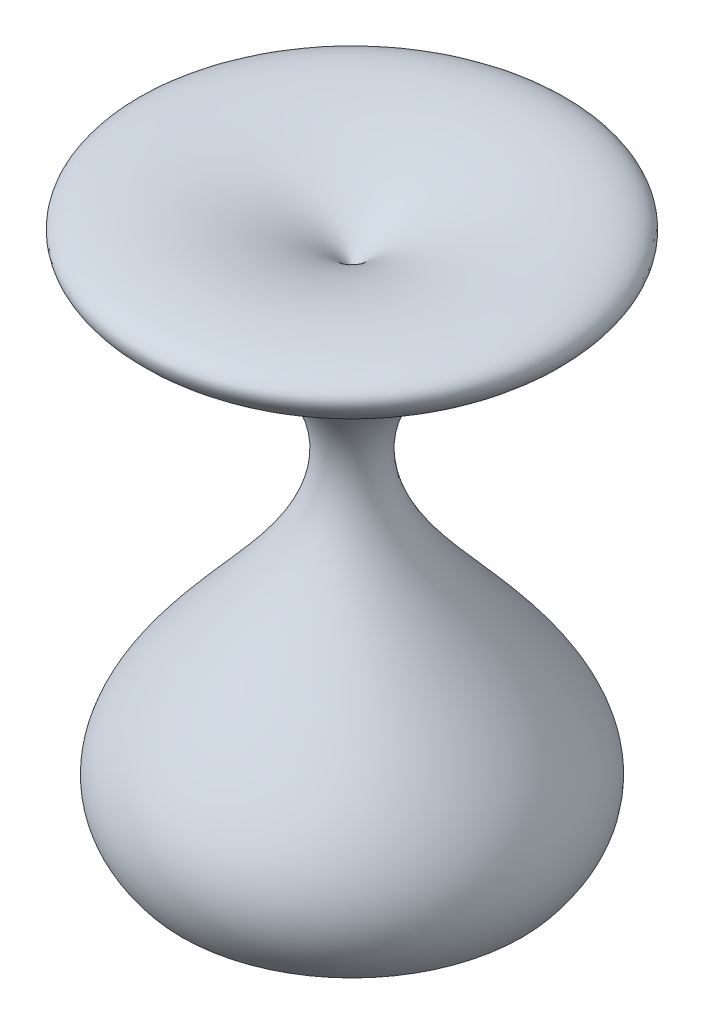
ISO-10303-21;
HEADER;
FILE_DESCRIPTION(('STEP AP214'),'2;1');
FILE_NAME('part.step','',(''),(''),'','','');
FILE_SCHEMA(('AUTOMOTIVE_DESIGN { 1 0 10303 214 1 1 1 1 }'));
ENDSEC;
DATA;
#1=APPLICATION_CONTEXT('core data for automotive mechanical design processes');
#2=APPLICATION_PROTOCOL_DEFINITION('international standard','automotive_design',2000,#1);
#3=PRODUCT_CONTEXT('',#1,'mechanical');
#4=PRODUCT('Part','Part','',(#3));
#5=PRODUCT_RELATED_PRODUCT_CATEGORY('part','',(#4));
#6=PRODUCT_DEFINITION_FORMATION('','',#4);
#7=PRODUCT_DEFINITION_CONTEXT('part definition',#1,'design');
#8=PRODUCT_DEFINITION('design','',#6,#7);
#9=PRODUCT_DEFINITION_SHAPE('','',#8);
#10=(LENGTH_UNIT() NAMED_UNIT(*) SI_UNIT(.MILLI.,.METRE.));
#11=(NAMED_UNIT(*) PLANE_ANGLE_UNIT() SI_UNIT($,.RADIAN.));
#12=(NAMED_UNIT(*) SI_UNIT($,.STERADIAN.) SOLID_ANGLE_UNIT());
#13=UNCERTAINTY_MEASURE_WITH_UNIT(LENGTH_MEASURE(1.E-05),#10,'distance_accuracy_value','');
#14=(GEOMETRIC_REPRESENTATION_CONTEXT(3) GLOBAL_UNCERTAINTY_ASSIGNED_CONTEXT((#13)) GLOBAL_UNIT_ASSIGNED_CONTEXT((#10,
#11,#12)) REPRESENTATION_CONTEXT('',''));
#15=CARTESIAN_POINT('',(0.,0.,0.));
#16=DIRECTION('',(0.,0.,1.));
#17=DIRECTION('',(1.,0.,0.));
#18=AXIS2_PLACEMENT_3D('',#15,#16,#17);
#19=CARTESIAN_POINT('',(33.007781624326,19.8676266592741,0.));
#20=CARTESIAN_POINT('',(27.7842273828248,28.0272960785586,0.));
#21=CARTESIAN_POINT('',(-3.21591991762805,27.2898636709325,0.));
#22=CARTESIAN_POINT('',(21.1502774594259,17.2186097713709,0.));
#23=B_SPLINE_CURVE_WITH_KNOTS('',3,(#19,#20,#21,#22),.UNSPECIFIED.,.F.,.F.,(4,4),(0.,1.),.UNSPECIFIED.);
#24=CARTESIAN_POINT('',(33.007781624326,30.7159815335444,0.));
#25=DIRECTION('',(0.,1.,0.));
#26=AXIS1_PLACEMENT('',#24,#25);
#27=SURFACE_OF_REVOLUTION('',#23,#26);
#28=CARTESIAN_POINT('',(33.007781624326,17.2186097713709,0.));
#29=DIRECTION('',(0.,1.,0.));
#30=DIRECTION('',(0.,0.,1.));
#31=AXIS2_PLACEMENT_3D('',#28,#29,#30);
#32=CIRCLE('',#31,11.8575041649001);
#33=CARTESIAN_POINT('',(33.007781624326,17.2186097713709,11.8575041649001));
#34=VERTEX_POINT('',#33);
#35=EDGE_CURVE('E11',#34,#34,#32,.T.);
#36=ORIENTED_EDGE('',*,*,#35,.T.);
#37=EDGE_LOOP('',(#36));
#38=FACE_BOUND('',#37,.T.);
#39=CARTESIAN_POINT('',(33.007781624326,19.8676266592741,0.));
#40=VERTEX_POINT('',#39);
#41=VERTEX_LOOP('',#40);
#42=FACE_BOUND('',#41,.T.);
#43=ADVANCED_FACE('F33',(#38,#42),#27,.F.);
#44=CARTESIAN_POINT('',(21.1502774594259,17.2186097713709,0.));
#45=CARTESIAN_POINT('',(50.5819483796968,-2.25593179516555,0.));
#46=CARTESIAN_POINT('',(-4.10617708916367,-15.6866174810792,0.));
#47=CARTESIAN_POINT('',(21.1502774594259,-32.1035618081604,0.));
#48=B_SPLINE_CURVE_WITH_KNOTS('',3,(#44,#45,#46,#47),.UNSPECIFIED.,.F.,.F.,(4,4),(0.,1.),.UNSPECIFIED.);
#49=CARTESIAN_POINT('',(33.007781624326,30.7159815335444,0.));
#50=DIRECTION('',(0.,1.,0.));
#51=AXIS1_PLACEMENT('',#49,#50);
#52=SURFACE_OF_REVOLUTION('',#48,#51);
#53=CARTESIAN_POINT('',(33.007781624326,-28.0615678253412,0.));
#54=DIRECTION('',(0.,1.,0.));
#55=DIRECTION('',(0.,0.,1.));
#56=AXIS2_PLACEMENT_3D('',#53,#54,#55);
#57=CIRCLE('',#56,16.5967506788731);
#58=CARTESIAN_POINT('',(33.007781624326,-28.0615678253412,16.5967506788731));
#59=VERTEX_POINT('',#58);
#60=EDGE_CURVE('E37',#59,#59,#57,.F.);
#61=ORIENTED_EDGE('',*,*,#60,.F.);
#62=EDGE_LOOP('',(#61));
#63=FACE_BOUND('',#62,.T.);
#64=ORIENTED_EDGE('',*,*,#35,.F.);
#65=EDGE_LOOP('',(#64));
#66=FACE_BOUND('',#65,.T.);
#67=ADVANCED_FACE('F44',(#63,#66),#52,.F.);
#68=CARTESIAN_POINT('',(33.007781624326,-27.1035618081604,0.));
#69=DIRECTION('',(0.,-1.,0.));
#70=DIRECTION('',(0.,0.,-1.));
#71=AXIS2_PLACEMENT_3D('',#68,#69,#70);
#72=CYLINDRICAL_SURFACE('',#71,16.5967506788731);
#73=ORIENTED_EDGE('',*,*,#60,.T.);
#74=EDGE_LOOP('',(#73));
#75=FACE_BOUND('',#74,.T.);
#76=CARTESIAN_POINT('',(33.007781624326,-27.1035618081604,0.));
#77=DIRECTION('',(0.,-1.,0.));
#78=DIRECTION('',(0.,0.,-1.));
#79=AXIS2_PLACEMENT_3D('',#76,#77,#78);
#80=CIRCLE('',#79,16.5967506788731);
#81=CARTESIAN_POINT('',(33.007781624326,-27.1035618081604,-16.5967506788731));
#82=VERTEX_POINT('',#81);
#83=EDGE_CURVE('E72',#82,#82,#80,.T.);
#84=ORIENTED_EDGE('',*,*,#83,.F.);
#85=EDGE_LOOP('',(#84));
#86=FACE_BOUND('',#85,.T.);
#87=ADVANCED_FACE('F49',(#75,#86),#72,.F.);
#88=CARTESIAN_POINT('',(33.007781624326,-27.1035618081604,0.));
#89=DIRECTION('',(0.,-1.,0.));
#90=DIRECTION('',(0.,0.,-1.));
#91=AXIS2_PLACEMENT_3D('',#88,#89,#90);
#92=PLANE('',#91);
#93=ORIENTED_EDGE('',*,*,#83,.T.);
#94=EDGE_LOOP('',(#93));
#95=FACE_BOUND('',#94,.T.);
#96=ADVANCED_FACE('F56',(#95),#92,.T.);
#97=CLOSED_SHELL('',(#43,#67,#87,#96));
#98=MANIFOLD_SOLID_BREP('B2',#97);
#99=ADVANCED_BREP_SHAPE_REPRESENTATION('',(#18,#98),#14);
#100=SHAPE_DEFINITION_REPRESENTATION(#9,#99);
ENDSEC;
END-ISO-10303-21;
